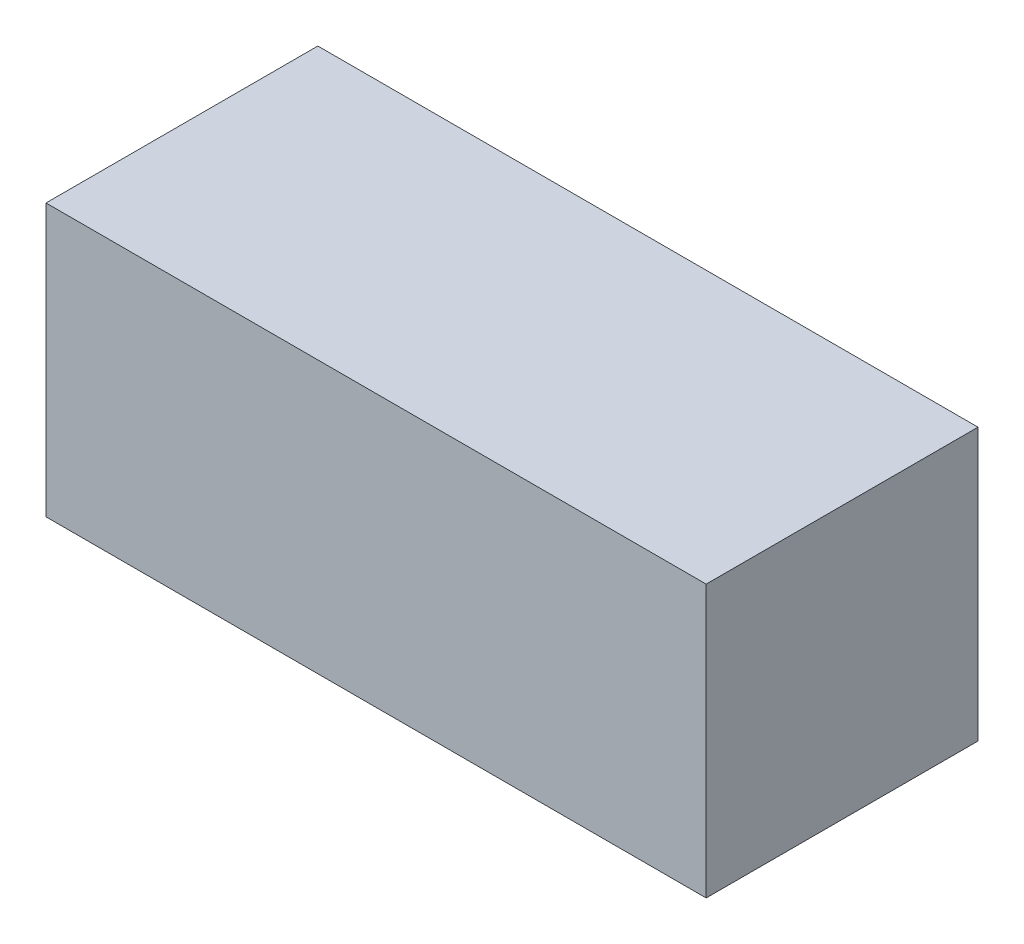
ISO-10303-21;
HEADER;
FILE_DESCRIPTION(('STEP AP214'),'2;1');
FILE_NAME('part.step','',(''),(''),'','','');
FILE_SCHEMA(('AUTOMOTIVE_DESIGN { 1 0 10303 214 1 1 1 1 }'));
ENDSEC;
DATA;
#1=APPLICATION_CONTEXT('core data for automotive mechanical design processes');
#2=APPLICATION_PROTOCOL_DEFINITION('international standard','automotive_design',2000,#1);
#3=PRODUCT_CONTEXT('',#1,'mechanical');
#4=PRODUCT('Part','Part','',(#3));
#5=PRODUCT_RELATED_PRODUCT_CATEGORY('part','',(#4));
#6=PRODUCT_DEFINITION_FORMATION('','',#4);
#7=PRODUCT_DEFINITION_CONTEXT('part definition',#1,'design');
#8=PRODUCT_DEFINITION('design','',#6,#7);
#9=PRODUCT_DEFINITION_SHAPE('','',#8);
#10=(LENGTH_UNIT() NAMED_UNIT(*) SI_UNIT(.MILLI.,.METRE.));
#11=(NAMED_UNIT(*) PLANE_ANGLE_UNIT() SI_UNIT($,.RADIAN.));
#12=(NAMED_UNIT(*) SI_UNIT($,.STERADIAN.) SOLID_ANGLE_UNIT());
#13=UNCERTAINTY_MEASURE_WITH_UNIT(LENGTH_MEASURE(1.E-05),#10,'distance_accuracy_value','');
#14=(GEOMETRIC_REPRESENTATION_CONTEXT(3) GLOBAL_UNCERTAINTY_ASSIGNED_CONTEXT((#13)) GLOBAL_UNIT_ASSIGNED_CONTEXT((#10,
#11,#12)) REPRESENTATION_CONTEXT('',''));
#15=CARTESIAN_POINT('',(0.,0.,0.));
#16=DIRECTION('',(0.,0.,1.));
#17=DIRECTION('',(1.,0.,0.));
#18=AXIS2_PLACEMENT_3D('',#15,#16,#17);
#19=CARTESIAN_POINT('',(85.,-35.,35.));
#20=DIRECTION('',(-1.,0.,0.));
#21=DIRECTION('',(0.,0.,1.));
#22=AXIS2_PLACEMENT_3D('',#19,#20,#21);
#23=PLANE('',#22);
#24=DIRECTION('',(0.,1.,0.));
#25=VECTOR('',#24,1.);
#26=CARTESIAN_POINT('',(85.,-35.,-35.));
#27=LINE('',#26,#25);
#28=CARTESIAN_POINT('',(85.,-35.,-35.));
#29=VERTEX_POINT('',#28);
#30=CARTESIAN_POINT('',(85.,35.,-35.));
#31=VERTEX_POINT('',#30);
#32=EDGE_CURVE('E107',#29,#31,#27,.T.);
#33=ORIENTED_EDGE('',*,*,#32,.T.);
#34=DIRECTION('',(0.,0.,-1.));
#35=VECTOR('',#34,1.);
#36=CARTESIAN_POINT('',(85.,35.,35.));
#37=LINE('',#36,#35);
#38=CARTESIAN_POINT('',(85.,35.,35.));
#39=VERTEX_POINT('',#38);
#40=EDGE_CURVE('E11',#39,#31,#37,.T.);
#41=ORIENTED_EDGE('',*,*,#40,.F.);
#42=DIRECTION('',(0.,1.,0.));
#43=VECTOR('',#42,1.);
#44=CARTESIAN_POINT('',(85.,-35.,35.));
#45=LINE('',#44,#43);
#46=CARTESIAN_POINT('',(85.,-35.,35.));
#47=VERTEX_POINT('',#46);
#48=EDGE_CURVE('E91',#47,#39,#45,.T.);
#49=ORIENTED_EDGE('',*,*,#48,.F.);
#50=DIRECTION('',(0.,0.,-1.));
#51=VECTOR('',#50,1.);
#52=CARTESIAN_POINT('',(85.,-35.,35.));
#53=LINE('',#52,#51);
#54=EDGE_CURVE('E103',#47,#29,#53,.T.);
#55=ORIENTED_EDGE('',*,*,#54,.T.);
#56=EDGE_LOOP('',(#33,#41,#49,#55));
#57=FACE_BOUND('',#56,.T.);
#58=ADVANCED_FACE('F39',(#57),#23,.F.);
#59=CARTESIAN_POINT('',(-85.0000000000001,35.,35.));
#60=DIRECTION('',(0.,-1.,0.));
#61=DIRECTION('',(0.,0.,-1.));
#62=AXIS2_PLACEMENT_3D('',#59,#60,#61);
#63=PLANE('',#62);
#64=DIRECTION('',(-1.,0.,0.));
#65=VECTOR('',#64,1.);
#66=CARTESIAN_POINT('',(-85.0000000000001,35.,-35.));
#67=LINE('',#66,#65);
#68=CARTESIAN_POINT('',(-85.0000000000001,35.,-35.));
#69=VERTEX_POINT('',#68);
#70=EDGE_CURVE('E96',#31,#69,#67,.T.);
#71=ORIENTED_EDGE('',*,*,#70,.T.);
#72=DIRECTION('',(0.,0.,-1.));
#73=VECTOR('',#72,1.);
#74=CARTESIAN_POINT('',(-85.0000000000001,35.,35.));
#75=LINE('',#74,#73);
#76=CARTESIAN_POINT('',(-85.0000000000001,35.,35.));
#77=VERTEX_POINT('',#76);
#78=EDGE_CURVE('E48',#77,#69,#75,.T.);
#79=ORIENTED_EDGE('',*,*,#78,.F.);
#80=DIRECTION('',(-1.,0.,0.));
#81=VECTOR('',#80,1.);
#82=CARTESIAN_POINT('',(-85.0000000000001,35.,35.));
#83=LINE('',#82,#81);
#84=EDGE_CURVE('E86',#39,#77,#83,.T.);
#85=ORIENTED_EDGE('',*,*,#84,.F.);
#86=ORIENTED_EDGE('',*,*,#40,.T.);
#87=EDGE_LOOP('',(#71,#79,#85,#86));
#88=FACE_BOUND('',#87,.T.);
#89=ADVANCED_FACE('F95',(#88),#63,.F.);
#90=CARTESIAN_POINT('',(-85.0000000000001,-35.,35.));
#91=DIRECTION('',(1.,0.,0.));
#92=DIRECTION('',(0.,0.,-1.));
#93=AXIS2_PLACEMENT_3D('',#90,#91,#92);
#94=PLANE('',#93);
#95=DIRECTION('',(0.,-1.,0.));
#96=VECTOR('',#95,1.);
#97=CARTESIAN_POINT('',(-85.0000000000001,-35.,-35.));
#98=LINE('',#97,#96);
#99=CARTESIAN_POINT('',(-85.0000000000001,-35.,-35.));
#100=VERTEX_POINT('',#99);
#101=EDGE_CURVE('E73',#69,#100,#98,.T.);
#102=ORIENTED_EDGE('',*,*,#101,.T.);
#103=DIRECTION('',(0.,0.,-1.));
#104=VECTOR('',#103,1.);
#105=CARTESIAN_POINT('',(-85.0000000000001,-35.,35.));
#106=LINE('',#105,#104);
#107=CARTESIAN_POINT('',(-85.0000000000001,-35.,35.));
#108=VERTEX_POINT('',#107);
#109=EDGE_CURVE('E98',#108,#100,#106,.T.);
#110=ORIENTED_EDGE('',*,*,#109,.F.);
#111=DIRECTION('',(0.,-1.,0.));
#112=VECTOR('',#111,1.);
#113=CARTESIAN_POINT('',(-85.0000000000001,-35.,35.));
#114=LINE('',#113,#112);
#115=EDGE_CURVE('E89',#77,#108,#114,.T.);
#116=ORIENTED_EDGE('',*,*,#115,.F.);
#117=ORIENTED_EDGE('',*,*,#78,.T.);
#118=EDGE_LOOP('',(#102,#110,#116,#117));
#119=FACE_BOUND('',#118,.T.);
#120=ADVANCED_FACE('F99',(#119),#94,.F.);
#121=CARTESIAN_POINT('',(-85.0000000000001,-35.,35.));
#122=DIRECTION('',(0.,1.,0.));
#123=DIRECTION('',(0.,0.,1.));
#124=AXIS2_PLACEMENT_3D('',#121,#122,#123);
#125=PLANE('',#124);
#126=DIRECTION('',(1.,0.,0.));
#127=VECTOR('',#126,1.);
#128=CARTESIAN_POINT('',(-85.0000000000001,-35.,-35.));
#129=LINE('',#128,#127);
#130=EDGE_CURVE('E79',#100,#29,#129,.T.);
#131=ORIENTED_EDGE('',*,*,#130,.T.);
#132=ORIENTED_EDGE('',*,*,#54,.F.);
#133=DIRECTION('',(1.,0.,0.));
#134=VECTOR('',#133,1.);
#135=CARTESIAN_POINT('',(-85.0000000000001,-35.,35.));
#136=LINE('',#135,#134);
#137=EDGE_CURVE('E56',#108,#47,#136,.T.);
#138=ORIENTED_EDGE('',*,*,#137,.F.);
#139=ORIENTED_EDGE('',*,*,#109,.T.);
#140=EDGE_LOOP('',(#131,#132,#138,#139));
#141=FACE_BOUND('',#140,.T.);
#142=ADVANCED_FACE('F120',(#141),#125,.F.);
#143=CARTESIAN_POINT('',(0.,0.,35.));
#144=DIRECTION('',(0.,0.,-1.));
#145=DIRECTION('',(-1.,0.,0.));
#146=AXIS2_PLACEMENT_3D('',#143,#144,#145);
#147=PLANE('',#146);
#148=ORIENTED_EDGE('',*,*,#48,.T.);
#149=ORIENTED_EDGE('',*,*,#84,.T.);
#150=ORIENTED_EDGE('',*,*,#115,.T.);
#151=ORIENTED_EDGE('',*,*,#137,.T.);
#152=EDGE_LOOP('',(#148,#149,#150,#151));
#153=FACE_BOUND('',#152,.T.);
#154=ADVANCED_FACE('F87',(#153),#147,.F.);
#155=CARTESIAN_POINT('',(0.,0.,-35.));
#156=DIRECTION('',(0.,0.,-1.));
#157=DIRECTION('',(-1.,0.,0.));
#158=AXIS2_PLACEMENT_3D('',#155,#156,#157);
#159=PLANE('',#158);
#160=ORIENTED_EDGE('',*,*,#32,.F.);
#161=ORIENTED_EDGE('',*,*,#130,.F.);
#162=ORIENTED_EDGE('',*,*,#101,.F.);
#163=ORIENTED_EDGE('',*,*,#70,.F.);
#164=EDGE_LOOP('',(#160,#161,#162,#163));
#165=FACE_BOUND('',#164,.T.);
#166=ADVANCED_FACE('F123',(#165),#159,.T.);
#167=CLOSED_SHELL('',(#58,#89,#120,#142,#154,#166));
#168=MANIFOLD_SOLID_BREP('B2',#167);
#169=ADVANCED_BREP_SHAPE_REPRESENTATION('',(#18,#168),#14);
#170=SHAPE_DEFINITION_REPRESENTATION(#9,#169);
ENDSEC;
END-ISO-10303-21;
